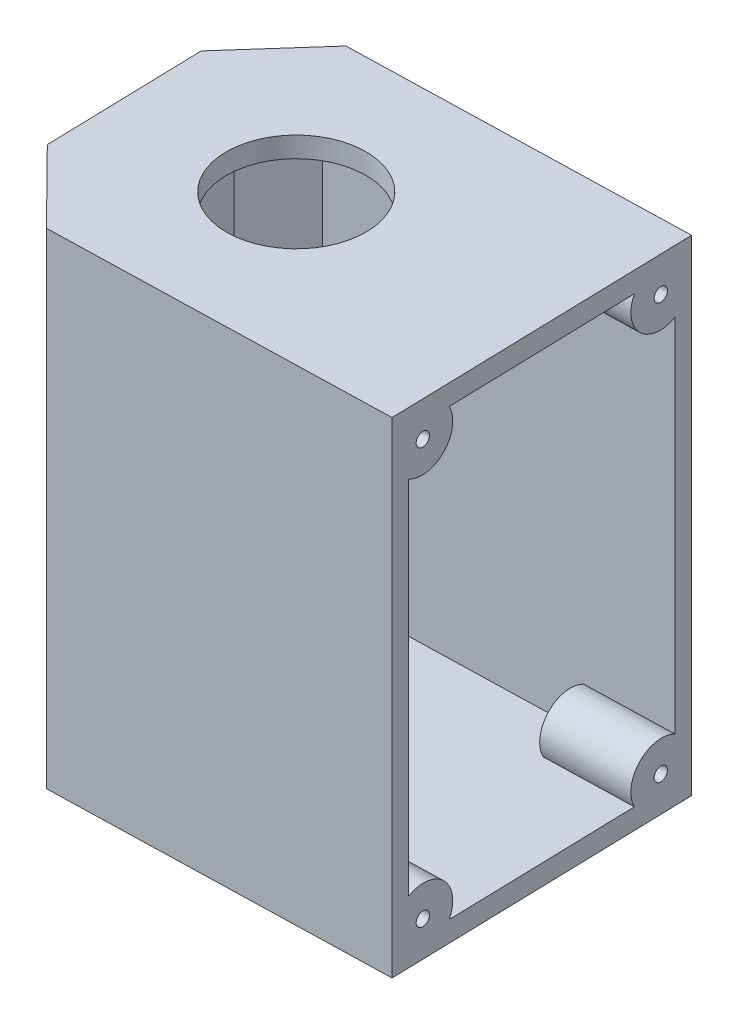
ISO-10303-21;
HEADER;
FILE_DESCRIPTION(('STEP AP214'),'2;1');
FILE_NAME('part.step','',(''),(''),'','','');
FILE_SCHEMA(('AUTOMOTIVE_DESIGN { 1 0 10303 214 1 1 1 1 }'));
ENDSEC;
DATA;
#1=APPLICATION_CONTEXT('core data for automotive mechanical design processes');
#2=APPLICATION_PROTOCOL_DEFINITION('international standard','automotive_design',2000,#1);
#3=PRODUCT_CONTEXT('',#1,'mechanical');
#4=PRODUCT('Part','Part','',(#3));
#5=PRODUCT_RELATED_PRODUCT_CATEGORY('part','',(#4));
#6=PRODUCT_DEFINITION_FORMATION('','',#4);
#7=PRODUCT_DEFINITION_CONTEXT('part definition',#1,'design');
#8=PRODUCT_DEFINITION('design','',#6,#7);
#9=PRODUCT_DEFINITION_SHAPE('','',#8);
#10=(LENGTH_UNIT() NAMED_UNIT(*) SI_UNIT(.MILLI.,.METRE.));
#11=(NAMED_UNIT(*) PLANE_ANGLE_UNIT() SI_UNIT($,.RADIAN.));
#12=(NAMED_UNIT(*) SI_UNIT($,.STERADIAN.) SOLID_ANGLE_UNIT());
#13=UNCERTAINTY_MEASURE_WITH_UNIT(LENGTH_MEASURE(1.E-05),#10,'distance_accuracy_value','');
#14=(GEOMETRIC_REPRESENTATION_CONTEXT(3) GLOBAL_UNCERTAINTY_ASSIGNED_CONTEXT((#13)) GLOBAL_UNIT_ASSIGNED_CONTEXT((#10,
#11,#12)) REPRESENTATION_CONTEXT('',''));
#15=CARTESIAN_POINT('',(0.,0.,0.));
#16=DIRECTION('',(0.,0.,1.));
#17=DIRECTION('',(1.,0.,0.));
#18=AXIS2_PLACEMENT_3D('',#15,#16,#17);
#19=CARTESIAN_POINT('',(0.,68.,0.));
#20=DIRECTION('',(0.,1.,0.));
#21=DIRECTION('',(0.,0.,1.));
#22=AXIS2_PLACEMENT_3D('',#19,#20,#21);
#23=PLANE('',#22);
#24=CARTESIAN_POINT('',(-17.8934203792558,68.,0.436006424415583));
#25=DIRECTION('',(0.,1.,0.));
#26=DIRECTION('',(0.,0.,1.));
#27=AXIS2_PLACEMENT_3D('',#24,#25,#26);
#28=CIRCLE('',#27,10.2);
#29=CARTESIAN_POINT('',(-17.8934203792558,68.,10.6360064244156));
#30=VERTEX_POINT('',#29);
#31=EDGE_CURVE('E319',#30,#30,#28,.F.);
#32=ORIENTED_EDGE('',*,*,#31,.F.);
#33=EDGE_LOOP('',(#32));
#34=FACE_BOUND('',#33,.T.);
#35=DIRECTION('',(-0.664307263992294,0.,0.747459603595454));
#36=VECTOR('',#35,1.);
#37=CARTESIAN_POINT('',(-28.3151559676767,68.,-25.1651911353096));
#38=LINE('',#37,#36);
#39=CARTESIAN_POINT('',(-33.6502390853678,68.,-19.1623076377953));
#40=VERTEX_POINT('',#39);
#41=CARTESIAN_POINT('',(-39.7506711500568,68.,-12.2982753142132));
#42=VERTEX_POINT('',#41);
#43=EDGE_CURVE('E182',#40,#42,#38,.T.);
#44=ORIENTED_EDGE('',*,*,#43,.F.);
#45=DIRECTION('',(0.999650770675558,0.,-0.0264260607689318));
#46=VECTOR('',#45,1.);
#47=CARTESIAN_POINT('',(-116.231008356699,68.,-16.9792608267229));
#48=LINE('',#47,#46);
#49=CARTESIAN_POINT('',(3.58326374035726,68.,-20.1465861850402));
#50=VERTEX_POINT('',#49);
#51=EDGE_CURVE('E189',#40,#50,#48,.T.);
#52=ORIENTED_EDGE('',*,*,#51,.T.);
#53=DIRECTION('',(-0.0264260607689318,0.,-0.999650770675558));
#54=VECTOR('',#53,1.);
#55=CARTESIAN_POINT('',(4.11297039872279,68.,-0.108727576555575));
#56=LINE('',#55,#54);
#57=CARTESIAN_POINT('',(3.74419705805505,68.,-14.0587656630687));
#58=VERTEX_POINT('',#57);
#59=EDGE_CURVE('E370',#58,#50,#56,.T.);
#60=ORIENTED_EDGE('',*,*,#59,.F.);
#61=DIRECTION('',(0.999650770675558,0.,-0.0264260607689318));
#62=VECTOR('',#61,1.);
#63=CARTESIAN_POINT('',(-49.1274945265591,68.,-12.6610870179285));
#64=LINE('',#63,#62);
#65=CARTESIAN_POINT('',(16.7396570768373,68.,-14.4023044530648));
#66=VERTEX_POINT('',#65);
#67=EDGE_CURVE('E255',#58,#66,#64,.T.);
#68=ORIENTED_EDGE('',*,*,#67,.T.);
#69=DIRECTION('',(0.0264260607689318,0.,0.999650770675558));
#70=VECTOR('',#69,1.);
#71=CARTESIAN_POINT('',(17.108430417505,68.,-0.452266366551688));
#72=LINE('',#71,#70);
#73=CARTESIAN_POINT('',(17.4752483112733,68.,13.4238006496144));
#74=VERTEX_POINT('',#73);
#75=EDGE_CURVE('E280',#66,#74,#72,.T.);
#76=ORIENTED_EDGE('',*,*,#75,.T.);
#77=DIRECTION('',(0.999650770675558,0.,-0.0264260607689318));
#78=VECTOR('',#77,1.);
#79=CARTESIAN_POINT('',(-48.3919032921231,68.,15.1650180847507));
#80=LINE('',#79,#78);
#81=CARTESIAN_POINT('',(4.479788292491,68.,13.7673394396105));
#82=VERTEX_POINT('',#81);
#83=EDGE_CURVE('E248',#82,#74,#80,.T.);
#84=ORIENTED_EDGE('',*,*,#83,.F.);
#85=CARTESIAN_POINT('',(4.64072161018879,68.,19.855159961582));
#86=VERTEX_POINT('',#85);
#87=EDGE_CURVE('E368',#86,#82,#56,.T.);
#88=ORIENTED_EDGE('',*,*,#87,.F.);
#89=DIRECTION('',(0.999650770675558,0.,-0.0264260607689318));
#90=VECTOR('',#89,1.);
#91=CARTESIAN_POINT('',(-115.173550486868,68.,23.0224853198993));
#92=LINE('',#91,#90);
#93=CARTESIAN_POINT('',(-32.5927812155363,68.,20.8394385088269));
#94=VERTEX_POINT('',#93);
#95=EDGE_CURVE('E207',#94,#86,#92,.T.);
#96=ORIENTED_EDGE('',*,*,#95,.F.);
#97=DIRECTION('',(0.702870473293746,0.,0.711317859871257));
#98=VECTOR('',#97,1.);
#99=CARTESIAN_POINT('',(-26.9100461971686,68.,26.5904709750769));
#100=LINE('',#99,#98);
#101=CARTESIAN_POINT('',(-39.0473449468371,68.,14.3073011745663));
#102=VERTEX_POINT('',#101);
#103=EDGE_CURVE('E326',#102,#94,#100,.T.);
#104=ORIENTED_EDGE('',*,*,#103,.F.);
#105=DIRECTION('',(0.0264260607689317,0.,0.999650770675558));
#106=VECTOR('',#105,1.);
#107=CARTESIAN_POINT('',(-39.3980303249972,68.,1.04149846535005));
#108=LINE('',#107,#106);
#109=EDGE_CURVE('E192',#42,#102,#108,.T.);
#110=ORIENTED_EDGE('',*,*,#109,.F.);
#111=EDGE_LOOP('',(#44,#52,#60,#68,#76,#84,#88,#96,#104,#110));
#112=FACE_BOUND('',#111,.T.);
#113=ADVANCED_FACE('F46',(#34,#112),#23,.F.);
#114=CARTESIAN_POINT('',(0.,3.,0.));
#115=DIRECTION('',(0.,1.,0.));
#116=DIRECTION('',(0.,0.,1.));
#117=AXIS2_PLACEMENT_3D('',#114,#115,#116);
#118=PLANE('',#117);
#119=CARTESIAN_POINT('',(-17.8934203792558,3.,0.436006424415583));
#120=DIRECTION('',(0.,1.,0.));
#121=DIRECTION('',(0.,0.,1.));
#122=AXIS2_PLACEMENT_3D('',#119,#120,#121);
#123=CIRCLE('',#122,4.5);
#124=CARTESIAN_POINT('',(-17.8934203792558,3.,4.93600642441559));
#125=VERTEX_POINT('',#124);
#126=EDGE_CURVE('E316',#125,#125,#123,.F.);
#127=ORIENTED_EDGE('',*,*,#126,.T.);
#128=EDGE_LOOP('',(#127));
#129=FACE_BOUND('',#128,.T.);
#130=DIRECTION('',(0.999650770675558,0.,-0.0264260607689318));
#131=VECTOR('',#130,1.);
#132=CARTESIAN_POINT('',(-116.231008356699,3.,-16.9792608267229));
#133=LINE('',#132,#131);
#134=CARTESIAN_POINT('',(-33.6502390853678,3.,-19.1623076377953));
#135=VERTEX_POINT('',#134);
#136=CARTESIAN_POINT('',(3.58326374035726,3.,-20.1465861850402));
#137=VERTEX_POINT('',#136);
#138=EDGE_CURVE('E200',#135,#137,#133,.T.);
#139=ORIENTED_EDGE('',*,*,#138,.F.);
#140=DIRECTION('',(-0.664307263992294,0.,0.747459603595454));
#141=VECTOR('',#140,1.);
#142=CARTESIAN_POINT('',(-28.3151559676767,3.,-25.1651911353096));
#143=LINE('',#142,#141);
#144=CARTESIAN_POINT('',(-39.7506711500568,3.,-12.2982753142132));
#145=VERTEX_POINT('',#144);
#146=EDGE_CURVE('E61',#135,#145,#143,.T.);
#147=ORIENTED_EDGE('',*,*,#146,.T.);
#148=DIRECTION('',(0.0264260607689317,0.,0.999650770675558));
#149=VECTOR('',#148,1.);
#150=CARTESIAN_POINT('',(-39.3980303249972,3.,1.04149846535005));
#151=LINE('',#150,#149);
#152=CARTESIAN_POINT('',(-39.0473449468371,3.,14.3073011745663));
#153=VERTEX_POINT('',#152);
#154=EDGE_CURVE('E271',#145,#153,#151,.T.);
#155=ORIENTED_EDGE('',*,*,#154,.T.);
#156=DIRECTION('',(0.702870473293746,0.,0.711317859871257));
#157=VECTOR('',#156,1.);
#158=CARTESIAN_POINT('',(-26.9100461971686,3.,26.5904709750769));
#159=LINE('',#158,#157);
#160=CARTESIAN_POINT('',(-32.5927812155363,3.,20.8394385088269));
#161=VERTEX_POINT('',#160);
#162=EDGE_CURVE('E327',#153,#161,#159,.T.);
#163=ORIENTED_EDGE('',*,*,#162,.T.);
#164=DIRECTION('',(0.999650770675558,0.,-0.0264260607689318));
#165=VECTOR('',#164,1.);
#166=CARTESIAN_POINT('',(-115.173550486868,3.,23.0224853198993));
#167=LINE('',#166,#165);
#168=CARTESIAN_POINT('',(4.64072161018879,3.,19.855159961582));
#169=VERTEX_POINT('',#168);
#170=EDGE_CURVE('E369',#161,#169,#167,.T.);
#171=ORIENTED_EDGE('',*,*,#170,.T.);
#172=DIRECTION('',(0.0264260607689318,0.,0.999650770675558));
#173=VECTOR('',#172,1.);
#174=CARTESIAN_POINT('',(4.11297039872279,3.,-0.108727576555575));
#175=LINE('',#174,#173);
#176=CARTESIAN_POINT('',(4.479788292491,3.,13.7673394396105));
#177=VERTEX_POINT('',#176);
#178=EDGE_CURVE('E315',#177,#169,#175,.T.);
#179=ORIENTED_EDGE('',*,*,#178,.F.);
#180=DIRECTION('',(0.999650770675558,0.,-0.0264260607689318));
#181=VECTOR('',#180,1.);
#182=CARTESIAN_POINT('',(-48.3919032921231,3.,15.1650180847507));
#183=LINE('',#182,#181);
#184=CARTESIAN_POINT('',(17.4752483112732,3.,13.4238006496144));
#185=VERTEX_POINT('',#184);
#186=EDGE_CURVE('E262',#177,#185,#183,.T.);
#187=ORIENTED_EDGE('',*,*,#186,.T.);
#188=DIRECTION('',(-0.0264260607689318,0.,-0.999650770675558));
#189=VECTOR('',#188,1.);
#190=CARTESIAN_POINT('',(17.636181628971,3.,19.5116211715859));
#191=LINE('',#190,#189);
#192=CARTESIAN_POINT('',(16.7396570768373,3.,-14.4023044530648));
#193=VERTEX_POINT('',#192);
#194=EDGE_CURVE('E293',#185,#193,#191,.T.);
#195=ORIENTED_EDGE('',*,*,#194,.T.);
#196=DIRECTION('',(0.999650770675558,0.,-0.0264260607689318));
#197=VECTOR('',#196,1.);
#198=CARTESIAN_POINT('',(-49.1274945265591,3.,-12.6610870179285));
#199=LINE('',#198,#197);
#200=CARTESIAN_POINT('',(3.74419705805505,3.,-14.0587656630687));
#201=VERTEX_POINT('',#200);
#202=EDGE_CURVE('E269',#201,#193,#199,.T.);
#203=ORIENTED_EDGE('',*,*,#202,.F.);
#204=DIRECTION('',(-0.0264260607689318,0.,-0.999650770675558));
#205=VECTOR('',#204,1.);
#206=CARTESIAN_POINT('',(4.11297039872279,3.,-0.108727576555575));
#207=LINE('',#206,#205);
#208=EDGE_CURVE('E204',#201,#137,#207,.T.);
#209=ORIENTED_EDGE('',*,*,#208,.T.);
#210=EDGE_LOOP('',(#139,#147,#155,#163,#171,#179,#187,#195,#203,#209));
#211=FACE_BOUND('',#210,.T.);
#212=ADVANCED_FACE('F401',(#129,#211),#118,.T.);
#213=CARTESIAN_POINT('',(-39.3980303249972,0.,1.04149846535005));
#214=DIRECTION('',(-0.999650770675558,0.,0.0264260607689317));
#215=DIRECTION('',(0.0264260607689317,0.,0.999650770675558));
#216=AXIS2_PLACEMENT_3D('',#213,#214,#215);
#217=PLANE('',#216);
#218=DIRECTION('',(0.,-1.,0.));
#219=VECTOR('',#218,1.);
#220=CARTESIAN_POINT('',(-39.7506711500568,0.,-12.2982753142132));
#221=LINE('',#220,#219);
#222=EDGE_CURVE('E193',#42,#145,#221,.T.);
#223=ORIENTED_EDGE('',*,*,#222,.F.);
#224=ORIENTED_EDGE('',*,*,#109,.T.);
#225=DIRECTION('',(0.,1.,0.));
#226=VECTOR('',#225,1.);
#227=CARTESIAN_POINT('',(-39.0473449468371,0.,14.3073011745663));
#228=LINE('',#227,#226);
#229=EDGE_CURVE('E54',#153,#102,#228,.T.);
#230=ORIENTED_EDGE('',*,*,#229,.F.);
#231=ORIENTED_EDGE('',*,*,#154,.F.);
#232=EDGE_LOOP('',(#223,#224,#230,#231));
#233=FACE_BOUND('',#232,.T.);
#234=ADVANCED_FACE('F330',(#233),#217,.F.);
#235=CARTESIAN_POINT('',(16.5787237591395,71.,-20.4901249750363));
#236=DIRECTION('',(0.0264260607689319,0.,0.999650770675558));
#237=DIRECTION('',(0.999650770675558,0.,-0.0264260607689319));
#238=AXIS2_PLACEMENT_3D('',#235,#236,#237);
#239=PLANE('',#238);
#240=ORIENTED_EDGE('',*,*,#51,.F.);
#241=DIRECTION('',(0.,-1.,0.));
#242=VECTOR('',#241,1.);
#243=CARTESIAN_POINT('',(-33.6502390853678,71.,-19.1623076377953));
#244=LINE('',#243,#242);
#245=EDGE_CURVE('E11',#40,#135,#244,.T.);
#246=ORIENTED_EDGE('',*,*,#245,.T.);
#247=ORIENTED_EDGE('',*,*,#138,.T.);
#248=DIRECTION('',(0.,-1.,0.));
#249=VECTOR('',#248,1.);
#250=CARTESIAN_POINT('',(3.58326374035726,0.,-20.1465861850402));
#251=LINE('',#250,#249);
#252=CARTESIAN_POINT('',(3.58326374035726,9.08994731015653,-20.1465861850402));
#253=VERTEX_POINT('',#252);
#254=EDGE_CURVE('E199',#253,#137,#251,.T.);
#255=ORIENTED_EDGE('',*,*,#254,.F.);
#256=DIRECTION('',(0.999650770675558,0.,-0.0264260607689318));
#257=VECTOR('',#256,1.);
#258=CARTESIAN_POINT('',(-49.2884278442568,9.08994731015653,-18.7489075399));
#259=LINE('',#258,#257);
#260=CARTESIAN_POINT('',(16.5787237591395,9.08994731015653,-20.4901249750363));
#261=VERTEX_POINT('',#260);
#262=EDGE_CURVE('E268',#253,#261,#259,.T.);
#263=ORIENTED_EDGE('',*,*,#262,.T.);
#264=DIRECTION('',(0.,-1.,0.));
#265=VECTOR('',#264,1.);
#266=CARTESIAN_POINT('',(16.5787237591395,71.,-20.4901249750363));
#267=LINE('',#266,#265);
#268=CARTESIAN_POINT('',(16.5787237591395,61.9100526898435,-20.4901249750363));
#269=VERTEX_POINT('',#268);
#270=EDGE_CURVE('E296',#269,#261,#267,.T.);
#271=ORIENTED_EDGE('',*,*,#270,.F.);
#272=DIRECTION('',(0.999650770675558,0.,-0.0264260607689318));
#273=VECTOR('',#272,1.);
#274=CARTESIAN_POINT('',(-49.2884278442568,61.9100526898435,-18.7489075399));
#275=LINE('',#274,#273);
#276=CARTESIAN_POINT('',(3.58326374035726,61.9100526898435,-20.1465861850402));
#277=VERTEX_POINT('',#276);
#278=EDGE_CURVE('E254',#277,#269,#275,.T.);
#279=ORIENTED_EDGE('',*,*,#278,.F.);
#280=EDGE_CURVE('E198',#50,#277,#251,.T.);
#281=ORIENTED_EDGE('',*,*,#280,.F.);
#282=EDGE_LOOP('',(#240,#246,#247,#255,#263,#271,#279,#281));
#283=FACE_BOUND('',#282,.T.);
#284=ADVANCED_FACE('F196',(#283),#239,.T.);
#285=CARTESIAN_POINT('',(-52.3655645176512,71.,21.3621378238682));
#286=DIRECTION('',(-0.026426060768932,0.,-0.999650770675558));
#287=DIRECTION('',(-0.999650770675558,0.,0.026426060768932));
#288=AXIS2_PLACEMENT_3D('',#285,#286,#287);
#289=PLANE('',#288);
#290=ORIENTED_EDGE('',*,*,#170,.F.);
#291=DIRECTION('',(0.,1.,0.));
#292=VECTOR('',#291,1.);
#293=CARTESIAN_POINT('',(-32.5927812155363,71.,20.8394385088269));
#294=LINE('',#293,#292);
#295=EDGE_CURVE('E68',#161,#94,#294,.T.);
#296=ORIENTED_EDGE('',*,*,#295,.T.);
#297=ORIENTED_EDGE('',*,*,#95,.T.);
#298=DIRECTION('',(0.,1.,0.));
#299=VECTOR('',#298,1.);
#300=CARTESIAN_POINT('',(4.64072161018879,0.,19.855159961582));
#301=LINE('',#300,#299);
#302=CARTESIAN_POINT('',(4.64072161018879,61.9100526898435,19.855159961582));
#303=VERTEX_POINT('',#302);
#304=EDGE_CURVE('E367',#303,#86,#301,.T.);
#305=ORIENTED_EDGE('',*,*,#304,.F.);
#306=DIRECTION('',(0.999650770675558,0.,-0.0264260607689318));
#307=VECTOR('',#306,1.);
#308=CARTESIAN_POINT('',(-48.2309699744253,61.9100526898435,21.2528386067222));
#309=LINE('',#308,#307);
#310=CARTESIAN_POINT('',(17.636181628971,61.9100526898435,19.5116211715859));
#311=VERTEX_POINT('',#310);
#312=EDGE_CURVE('E247',#303,#311,#309,.T.);
#313=ORIENTED_EDGE('',*,*,#312,.T.);
#314=DIRECTION('',(0.,-1.,0.));
#315=VECTOR('',#314,1.);
#316=CARTESIAN_POINT('',(17.636181628971,71.,19.5116211715859));
#317=LINE('',#316,#315);
#318=CARTESIAN_POINT('',(17.636181628971,9.08994731015653,19.5116211715859));
#319=VERTEX_POINT('',#318);
#320=EDGE_CURVE('E299',#311,#319,#317,.T.);
#321=ORIENTED_EDGE('',*,*,#320,.T.);
#322=DIRECTION('',(0.999650770675558,0.,-0.0264260607689318));
#323=VECTOR('',#322,1.);
#324=CARTESIAN_POINT('',(-48.2309699744253,9.08994731015653,21.2528386067222));
#325=LINE('',#324,#323);
#326=CARTESIAN_POINT('',(4.64072161018879,9.08994731015653,19.855159961582));
#327=VERTEX_POINT('',#326);
#328=EDGE_CURVE('E261',#327,#319,#325,.T.);
#329=ORIENTED_EDGE('',*,*,#328,.F.);
#330=EDGE_CURVE('E365',#169,#327,#301,.T.);
#331=ORIENTED_EDGE('',*,*,#330,.F.);
#332=EDGE_LOOP('',(#290,#296,#297,#305,#313,#321,#329,#331));
#333=FACE_BOUND('',#332,.T.);
#334=ADVANCED_FACE('F393',(#333),#289,.T.);
#335=CARTESIAN_POINT('',(0.,0.,0.));
#336=DIRECTION('',(0.,1.,0.));
#337=DIRECTION('',(0.,0.,1.));
#338=AXIS2_PLACEMENT_3D('',#335,#336,#337);
#339=PLANE('',#338);
#340=DIRECTION('',(0.664307263992294,0.,-0.747459603595454));
#341=VECTOR('',#340,1.);
#342=CARTESIAN_POINT('',(-29.0626155712721,0.,-25.8294983993019));
#343=LINE('',#342,#341);
#344=CARTESIAN_POINT('',(-42.7036780374664,0.,-10.4809636228995));
#345=VERTEX_POINT('',#344);
#346=CARTESIAN_POINT('',(-32.744156390403,0.,-21.6871335774113));
#347=VERTEX_POINT('',#346);
#348=EDGE_CURVE('E353',#345,#347,#343,.T.);
#349=ORIENTED_EDGE('',*,*,#348,.T.);
#350=DIRECTION('',(-0.999650770675558,0.,0.0264260607689319));
#351=VECTOR('',#350,1.);
#352=CARTESIAN_POINT('',(-55.9882144660939,0.,-21.0726700975206));
#353=LINE('',#352,#351);
#354=CARTESIAN_POINT('',(16.5126586072172,0.,-22.9892519017252));
#355=VERTEX_POINT('',#354);
#356=EDGE_CURVE('E309',#355,#347,#353,.T.);
#357=ORIENTED_EDGE('',*,*,#356,.F.);
#358=DIRECTION('',(-0.0264260607689318,0.,-0.999650770675558));
#359=VECTOR('',#358,1.);
#360=CARTESIAN_POINT('',(17.7022467808934,0.,22.0107480982748));
#361=LINE('',#360,#359);
#362=CARTESIAN_POINT('',(17.7022467808934,0.,22.0107480982748));
#363=VERTEX_POINT('',#362);
#364=EDGE_CURVE('E286',#363,#355,#361,.T.);
#365=ORIENTED_EDGE('',*,*,#364,.F.);
#366=DIRECTION('',(0.999650770675558,0.,-0.0264260607689319));
#367=VECTOR('',#366,1.);
#368=CARTESIAN_POINT('',(20.2013737075823,0.,21.9446829463524));
#369=LINE('',#368,#367);
#370=CARTESIAN_POINT('',(-31.5545682167268,0.,23.3128664225887));
#371=VERTEX_POINT('',#370);
#372=EDGE_CURVE('E307',#371,#363,#369,.T.);
#373=ORIENTED_EDGE('',*,*,#372,.F.);
#374=DIRECTION('',(0.702870473293746,0.,0.711317859871257));
#375=VECTOR('',#374,1.);
#376=CARTESIAN_POINT('',(-27.6213640570398,0.,27.2933414483706));
#377=LINE('',#376,#375);
#378=CARTESIAN_POINT('',(-42.0922426834808,0.,12.6485458478662));
#379=VERTEX_POINT('',#378);
#380=EDGE_CURVE('E347',#379,#371,#377,.T.);
#381=ORIENTED_EDGE('',*,*,#380,.F.);
#382=DIRECTION('',(0.0264260607689317,0.,0.999650770675558));
#383=VECTOR('',#382,1.);
#384=CARTESIAN_POINT('',(-42.9927544473117,0.,-21.4162088875167));
#385=LINE('',#384,#383);
#386=EDGE_CURVE('E274',#345,#379,#385,.T.);
#387=ORIENTED_EDGE('',*,*,#386,.F.);
#388=EDGE_LOOP('',(#349,#357,#365,#373,#381,#387));
#389=FACE_BOUND('',#388,.T.);
#390=CARTESIAN_POINT('',(-17.8934203792558,0.,0.436006424415583));
#391=DIRECTION('',(0.,-1.,0.));
#392=DIRECTION('',(0.,0.,-1.));
#393=AXIS2_PLACEMENT_3D('',#390,#391,#392);
#394=CIRCLE('',#393,4.5);
#395=CARTESIAN_POINT('',(-17.8934203792558,0.,-4.06399357558442));
#396=VERTEX_POINT('',#395);
#397=EDGE_CURVE('E318',#396,#396,#394,.T.);
#398=ORIENTED_EDGE('',*,*,#397,.F.);
#399=EDGE_LOOP('',(#398));
#400=FACE_BOUND('',#399,.T.);
#401=ADVANCED_FACE('F455',(#389,#400),#339,.F.);
#402=CARTESIAN_POINT('',(20.2013737075823,3.,21.9446829463524));
#403=DIRECTION('',(-0.0264260607689319,0.,-0.999650770675558));
#404=DIRECTION('',(-0.999650770675558,0.,0.0264260607689319));
#405=AXIS2_PLACEMENT_3D('',#402,#403,#404);
#406=PLANE('',#405);
#407=DIRECTION('',(0.,1.,0.));
#408=VECTOR('',#407,1.);
#409=CARTESIAN_POINT('',(-31.5545682167268,-125.999999999999,23.3128664225887));
#410=LINE('',#409,#408);
#411=CARTESIAN_POINT('',(-31.5545682167268,71.,23.3128664225887));
#412=VERTEX_POINT('',#411);
#413=EDGE_CURVE('E343',#371,#412,#410,.T.);
#414=ORIENTED_EDGE('',*,*,#413,.F.);
#415=ORIENTED_EDGE('',*,*,#372,.T.);
#416=DIRECTION('',(0.,-1.,0.));
#417=VECTOR('',#416,1.);
#418=CARTESIAN_POINT('',(17.7022467808934,71.,22.0107480982748));
#419=LINE('',#418,#417);
#420=CARTESIAN_POINT('',(17.7022467808934,71.,22.0107480982748));
#421=VERTEX_POINT('',#420);
#422=EDGE_CURVE('E283',#421,#363,#419,.T.);
#423=ORIENTED_EDGE('',*,*,#422,.F.);
#424=DIRECTION('',(0.999650770675558,0.,-0.0264260607689319));
#425=VECTOR('',#424,1.);
#426=CARTESIAN_POINT('',(-54.7986262924177,71.,23.9273299024794));
#427=LINE('',#426,#425);
#428=EDGE_CURVE('E302',#412,#421,#427,.T.);
#429=ORIENTED_EDGE('',*,*,#428,.F.);
#430=EDGE_LOOP('',(#414,#415,#423,#429));
#431=FACE_BOUND('',#430,.T.);
#432=ADVANCED_FACE('F48',(#431),#406,.F.);
#433=CARTESIAN_POINT('',(0.,71.,0.));
#434=DIRECTION('',(0.,1.,0.));
#435=DIRECTION('',(0.,0.,1.));
#436=AXIS2_PLACEMENT_3D('',#433,#434,#435);
#437=PLANE('',#436);
#438=DIRECTION('',(-0.999650770675558,0.,0.0264260607689319));
#439=VECTOR('',#438,1.);
#440=CARTESIAN_POINT('',(19.0117855339061,71.,-23.0553170536476));
#441=LINE('',#440,#439);
#442=CARTESIAN_POINT('',(16.5126586072172,71.,-22.9892519017252));
#443=VERTEX_POINT('',#442);
#444=CARTESIAN_POINT('',(-32.744156390403,71.,-21.6871335774113));
#445=VERTEX_POINT('',#444);
#446=EDGE_CURVE('E304',#443,#445,#441,.T.);
#447=ORIENTED_EDGE('',*,*,#446,.T.);
#448=DIRECTION('',(0.664307263992294,0.,-0.747459603595454));
#449=VECTOR('',#448,1.);
#450=CARTESIAN_POINT('',(-29.0626155712721,71.,-25.8294983993019));
#451=LINE('',#450,#449);
#452=CARTESIAN_POINT('',(-42.7036780374664,71.,-10.4809636228995));
#453=VERTEX_POINT('',#452);
#454=EDGE_CURVE('E340',#453,#445,#451,.T.);
#455=ORIENTED_EDGE('',*,*,#454,.F.);
#456=DIRECTION('',(-0.0264260607689317,0.,-0.999650770675558));
#457=VECTOR('',#456,1.);
#458=CARTESIAN_POINT('',(-41.8031662736355,71.,23.5837911124833));
#459=LINE('',#458,#457);
#460=CARTESIAN_POINT('',(-42.0922426834808,71.,12.6485458478662));
#461=VERTEX_POINT('',#460);
#462=EDGE_CURVE('E277',#461,#453,#459,.T.);
#463=ORIENTED_EDGE('',*,*,#462,.F.);
#464=DIRECTION('',(0.702870473293746,0.,0.711317859871257));
#465=VECTOR('',#464,1.);
#466=CARTESIAN_POINT('',(-27.6213640570398,71.,27.2933414483706));
#467=LINE('',#466,#465);
#468=EDGE_CURVE('E332',#461,#412,#467,.T.);
#469=ORIENTED_EDGE('',*,*,#468,.T.);
#470=ORIENTED_EDGE('',*,*,#428,.T.);
#471=DIRECTION('',(0.0264260607689318,0.,0.999650770675558));
#472=VECTOR('',#471,1.);
#473=CARTESIAN_POINT('',(16.5126586072172,71.,-22.9892519017252));
#474=LINE('',#473,#472);
#475=EDGE_CURVE('E290',#443,#421,#474,.T.);
#476=ORIENTED_EDGE('',*,*,#475,.F.);
#477=EDGE_LOOP('',(#447,#455,#463,#469,#470,#476));
#478=FACE_BOUND('',#477,.T.);
#479=CARTESIAN_POINT('',(-17.8934203792558,71.,0.436006424415583));
#480=DIRECTION('',(0.,1.,0.));
#481=DIRECTION('',(0.,0.,1.));
#482=AXIS2_PLACEMENT_3D('',#479,#480,#481);
#483=CIRCLE('',#482,10.2);
#484=CARTESIAN_POINT('',(-17.8934203792558,71.,10.6360064244156));
#485=VERTEX_POINT('',#484);
#486=EDGE_CURVE('E356',#485,#485,#483,.T.);
#487=ORIENTED_EDGE('',*,*,#486,.F.);
#488=EDGE_LOOP('',(#487));
#489=FACE_BOUND('',#488,.T.);
#490=ADVANCED_FACE('F456',(#478,#489),#437,.T.);
#491=CARTESIAN_POINT('',(-42.3969826370238,0.,1.12077664765685));
#492=DIRECTION('',(-0.999650770675558,0.,0.0264260607689317));
#493=DIRECTION('',(0.0264260607689317,0.,0.999650770675558));
#494=AXIS2_PLACEMENT_3D('',#491,#492,#493);
#495=PLANE('',#494);
#496=DIRECTION('',(0.,1.,0.));
#497=VECTOR('',#496,1.);
#498=CARTESIAN_POINT('',(-42.7036780374664,-125.999999999999,-10.4809636228995));
#499=LINE('',#498,#497);
#500=EDGE_CURVE('E342',#345,#453,#499,.T.);
#501=ORIENTED_EDGE('',*,*,#500,.F.);
#502=ORIENTED_EDGE('',*,*,#386,.T.);
#503=DIRECTION('',(0.,1.,0.));
#504=VECTOR('',#503,1.);
#505=CARTESIAN_POINT('',(-42.0922426834808,-125.999999999999,12.6485458478662));
#506=LINE('',#505,#504);
#507=EDGE_CURVE('E335',#379,#461,#506,.T.);
#508=ORIENTED_EDGE('',*,*,#507,.T.);
#509=ORIENTED_EDGE('',*,*,#462,.T.);
#510=EDGE_LOOP('',(#501,#502,#508,#509));
#511=FACE_BOUND('',#510,.T.);
#512=ADVANCED_FACE('F446',(#511),#495,.T.);
#513=CARTESIAN_POINT('',(-17.8934203792558,72.9999999999986,0.436006424415583));
#514=DIRECTION('',(0.,-1.,0.));
#515=DIRECTION('',(0.,0.,-1.));
#516=AXIS2_PLACEMENT_3D('',#513,#514,#515);
#517=CYLINDRICAL_SURFACE('',#516,4.5);
#518=ORIENTED_EDGE('',*,*,#397,.T.);
#519=EDGE_LOOP('',(#518));
#520=FACE_BOUND('',#519,.T.);
#521=ORIENTED_EDGE('',*,*,#126,.F.);
#522=EDGE_LOOP('',(#521));
#523=FACE_BOUND('',#522,.T.);
#524=ADVANCED_FACE('F463',(#520,#523),#517,.F.);
#525=CARTESIAN_POINT('',(-55.9882144660939,3.,-21.0726700975206));
#526=DIRECTION('',(0.0264260607689319,0.,0.999650770675558));
#527=DIRECTION('',(0.999650770675558,0.,-0.0264260607689319));
#528=AXIS2_PLACEMENT_3D('',#525,#526,#527);
#529=PLANE('',#528);
#530=ORIENTED_EDGE('',*,*,#356,.T.);
#531=DIRECTION('',(0.,1.,0.));
#532=VECTOR('',#531,1.);
#533=CARTESIAN_POINT('',(-32.744156390403,-125.999999999999,-21.6871335774113));
#534=LINE('',#533,#532);
#535=EDGE_CURVE('E344',#347,#445,#534,.T.);
#536=ORIENTED_EDGE('',*,*,#535,.T.);
#537=ORIENTED_EDGE('',*,*,#446,.F.);
#538=DIRECTION('',(0.,1.,0.));
#539=VECTOR('',#538,1.);
#540=CARTESIAN_POINT('',(16.5126586072172,0.,-22.9892519017252));
#541=LINE('',#540,#539);
#542=EDGE_CURVE('E288',#355,#443,#541,.T.);
#543=ORIENTED_EDGE('',*,*,#542,.F.);
#544=EDGE_LOOP('',(#530,#536,#537,#543));
#545=FACE_BOUND('',#544,.T.);
#546=ADVANCED_FACE('F450',(#545),#529,.F.);
#547=CARTESIAN_POINT('',(17.108430417505,0.,-0.452266366551688));
#548=DIRECTION('',(0.999650770675558,0.,-0.0264260607689318));
#549=DIRECTION('',(-0.0264260607689318,0.,-0.999650770675558));
#550=AXIS2_PLACEMENT_3D('',#547,#548,#549);
#551=PLANE('',#550);
#552=CARTESIAN_POINT('',(17.5801234886618,65.8786796564404,17.3910416552967));
#553=DIRECTION('',(0.999650770675558,0.,-0.0264260607689318));
#554=DIRECTION('',(-0.0264260607689318,0.,-0.999650770675558));
#555=AXIS2_PLACEMENT_3D('',#552,#553,#554);
#556=CIRCLE('',#555,4.5);
#557=EDGE_CURVE('E244',#311,#74,#556,.T.);
#558=ORIENTED_EDGE('',*,*,#557,.T.);
#559=ORIENTED_EDGE('',*,*,#75,.F.);
#560=CARTESIAN_POINT('',(16.6347818994488,65.8786796564404,-18.3695454587472));
#561=DIRECTION('',(0.999650770675558,0.,-0.0264260607689318));
#562=DIRECTION('',(-0.0264260607689318,0.,-0.999650770675558));
#563=AXIS2_PLACEMENT_3D('',#560,#561,#562);
#564=CIRCLE('',#563,4.5);
#565=EDGE_CURVE('E250',#269,#66,#564,.F.);
#566=ORIENTED_EDGE('',*,*,#565,.F.);
#567=ORIENTED_EDGE('',*,*,#270,.T.);
#568=CARTESIAN_POINT('',(16.6347818994488,5.12132034355964,-18.3695454587472));
#569=DIRECTION('',(0.999650770675558,0.,-0.0264260607689318));
#570=DIRECTION('',(-0.0264260607689318,0.,-0.999650770675558));
#571=AXIS2_PLACEMENT_3D('',#568,#569,#570);
#572=CIRCLE('',#571,4.5);
#573=EDGE_CURVE('E264',#261,#193,#572,.T.);
#574=ORIENTED_EDGE('',*,*,#573,.T.);
#575=ORIENTED_EDGE('',*,*,#194,.F.);
#576=CARTESIAN_POINT('',(17.5801234886618,5.12132034355964,17.3910416552967));
#577=DIRECTION('',(0.999650770675558,0.,-0.0264260607689318));
#578=DIRECTION('',(-0.0264260607689318,0.,-0.999650770675558));
#579=AXIS2_PLACEMENT_3D('',#576,#577,#578);
#580=CIRCLE('',#579,4.5);
#581=EDGE_CURVE('E257',#319,#185,#580,.F.);
#582=ORIENTED_EDGE('',*,*,#581,.F.);
#583=ORIENTED_EDGE('',*,*,#320,.F.);
#584=EDGE_LOOP('',(#558,#559,#566,#567,#574,#575,#582,#583));
#585=FACE_BOUND('',#584,.T.);
#586=ORIENTED_EDGE('',*,*,#475,.T.);
#587=ORIENTED_EDGE('',*,*,#422,.T.);
#588=ORIENTED_EDGE('',*,*,#364,.T.);
#589=ORIENTED_EDGE('',*,*,#542,.T.);
#590=EDGE_LOOP('',(#586,#587,#588,#589));
#591=FACE_BOUND('',#590,.T.);
#592=CARTESIAN_POINT('',(17.5801234886618,5.12132034355964,17.3910416552967));
#593=DIRECTION('',(0.999650770675558,0.,-0.0264260607689318));
#594=DIRECTION('',(-0.0264260607689318,0.,-0.999650770675558));
#595=AXIS2_PLACEMENT_3D('',#592,#593,#594);
#596=CIRCLE('',#595,1.);
#597=CARTESIAN_POINT('',(17.5536974278928,5.12132034355964,16.3913908846212));
#598=VERTEX_POINT('',#597);
#599=EDGE_CURVE('E241',#598,#598,#596,.T.);
#600=ORIENTED_EDGE('',*,*,#599,.F.);
#601=EDGE_LOOP('',(#600));
#602=FACE_BOUND('',#601,.T.);
#603=CARTESIAN_POINT('',(16.6347818994488,5.12132034355964,-18.3695454587472));
#604=DIRECTION('',(0.999650770675558,0.,-0.0264260607689318));
#605=DIRECTION('',(-0.0264260607689318,0.,-0.999650770675558));
#606=AXIS2_PLACEMENT_3D('',#603,#604,#605);
#607=CIRCLE('',#606,1.);
#608=CARTESIAN_POINT('',(16.6083558386799,5.12132034355964,-19.3691962294228));
#609=VERTEX_POINT('',#608);
#610=EDGE_CURVE('E238',#609,#609,#607,.T.);
#611=ORIENTED_EDGE('',*,*,#610,.F.);
#612=EDGE_LOOP('',(#611));
#613=FACE_BOUND('',#612,.T.);
#614=CARTESIAN_POINT('',(17.5801234886618,65.8786796564404,17.3910416552967));
#615=DIRECTION('',(0.999650770675558,0.,-0.0264260607689318));
#616=DIRECTION('',(-0.0264260607689318,0.,-0.999650770675558));
#617=AXIS2_PLACEMENT_3D('',#614,#615,#616);
#618=CIRCLE('',#617,1.);
#619=CARTESIAN_POINT('',(17.5536974278928,65.8786796564404,16.3913908846212));
#620=VERTEX_POINT('',#619);
#621=EDGE_CURVE('E235',#620,#620,#618,.T.);
#622=ORIENTED_EDGE('',*,*,#621,.F.);
#623=EDGE_LOOP('',(#622));
#624=FACE_BOUND('',#623,.T.);
#625=CARTESIAN_POINT('',(16.6347818994488,65.8786796564404,-18.3695454587472));
#626=DIRECTION('',(0.999650770675558,0.,-0.0264260607689318));
#627=DIRECTION('',(-0.0264260607689318,0.,-0.999650770675558));
#628=AXIS2_PLACEMENT_3D('',#625,#626,#627);
#629=CIRCLE('',#628,1.);
#630=CARTESIAN_POINT('',(16.6083558386799,65.8786796564404,-19.3691962294228));
#631=VERTEX_POINT('',#630);
#632=EDGE_CURVE('E232',#631,#631,#629,.T.);
#633=ORIENTED_EDGE('',*,*,#632,.F.);
#634=EDGE_LOOP('',(#633));
#635=FACE_BOUND('',#634,.T.);
#636=ADVANCED_FACE('F387',(#585,#591,#602,#613,#624,#635),#551,.T.);
#637=CARTESIAN_POINT('',(-49.2323697039476,5.12132034355964,-16.6283280236108));
#638=DIRECTION('',(0.999650770675558,0.,-0.0264260607689318));
#639=DIRECTION('',(-0.0264260607689318,0.,-0.999650770675558));
#640=AXIS2_PLACEMENT_3D('',#637,#638,#639);
#641=CYLINDRICAL_SURFACE('',#640,4.5);
#642=CARTESIAN_POINT('',(3.63932188066653,5.12132034355964,-18.0260066687511));
#643=DIRECTION('',(0.999650770675558,0.,-0.0264260607689318));
#644=DIRECTION('',(-0.0264260607689318,0.,-0.999650770675558));
#645=AXIS2_PLACEMENT_3D('',#642,#643,#644);
#646=CIRCLE('',#645,4.5);
#647=EDGE_CURVE('E229',#201,#253,#646,.F.);
#648=ORIENTED_EDGE('',*,*,#647,.F.);
#649=ORIENTED_EDGE('',*,*,#202,.T.);
#650=ORIENTED_EDGE('',*,*,#573,.F.);
#651=ORIENTED_EDGE('',*,*,#262,.F.);
#652=EDGE_LOOP('',(#648,#649,#650,#651));
#653=FACE_BOUND('',#652,.T.);
#654=ADVANCED_FACE('F408',(#653),#641,.T.);
#655=CARTESIAN_POINT('',(-48.2870281147346,5.12132034355964,19.1322590904331));
#656=DIRECTION('',(0.999650770675558,0.,-0.0264260607689318));
#657=DIRECTION('',(-0.0264260607689318,0.,-0.999650770675558));
#658=AXIS2_PLACEMENT_3D('',#655,#656,#657);
#659=CYLINDRICAL_SURFACE('',#658,4.5);
#660=ORIENTED_EDGE('',*,*,#186,.F.);
#661=CARTESIAN_POINT('',(4.58466346987951,5.12132034355964,17.7345804452929));
#662=DIRECTION('',(0.999650770675558,0.,-0.0264260607689318));
#663=DIRECTION('',(-0.0264260607689318,0.,-0.999650770675558));
#664=AXIS2_PLACEMENT_3D('',#661,#662,#663);
#665=CIRCLE('',#664,4.5);
#666=EDGE_CURVE('E226',#177,#327,#665,.T.);
#667=ORIENTED_EDGE('',*,*,#666,.T.);
#668=ORIENTED_EDGE('',*,*,#328,.T.);
#669=ORIENTED_EDGE('',*,*,#581,.T.);
#670=EDGE_LOOP('',(#660,#667,#668,#669));
#671=FACE_BOUND('',#670,.T.);
#672=ADVANCED_FACE('F397',(#671),#659,.T.);
#673=CARTESIAN_POINT('',(-49.2323697039476,65.8786796564404,-16.6283280236108));
#674=DIRECTION('',(0.999650770675558,0.,-0.0264260607689318));
#675=DIRECTION('',(-0.0264260607689318,0.,-0.999650770675558));
#676=AXIS2_PLACEMENT_3D('',#673,#674,#675);
#677=CYLINDRICAL_SURFACE('',#676,4.5);
#678=ORIENTED_EDGE('',*,*,#67,.F.);
#679=CARTESIAN_POINT('',(3.63932188066653,65.8786796564404,-18.0260066687511));
#680=DIRECTION('',(0.999650770675558,0.,-0.0264260607689318));
#681=DIRECTION('',(-0.0264260607689318,0.,-0.999650770675558));
#682=AXIS2_PLACEMENT_3D('',#679,#680,#681);
#683=CIRCLE('',#682,4.5);
#684=EDGE_CURVE('E223',#58,#277,#683,.T.);
#685=ORIENTED_EDGE('',*,*,#684,.T.);
#686=ORIENTED_EDGE('',*,*,#278,.T.);
#687=ORIENTED_EDGE('',*,*,#565,.T.);
#688=EDGE_LOOP('',(#678,#685,#686,#687));
#689=FACE_BOUND('',#688,.T.);
#690=ADVANCED_FACE('F414',(#689),#677,.T.);
#691=CARTESIAN_POINT('',(-48.2870281147346,65.8786796564404,19.1322590904331));
#692=DIRECTION('',(0.999650770675558,0.,-0.0264260607689318));
#693=DIRECTION('',(-0.0264260607689318,0.,-0.999650770675558));
#694=AXIS2_PLACEMENT_3D('',#691,#692,#693);
#695=CYLINDRICAL_SURFACE('',#694,4.5);
#696=CARTESIAN_POINT('',(4.58466346987951,65.8786796564404,17.7345804452929));
#697=DIRECTION('',(0.999650770675558,0.,-0.0264260607689318));
#698=DIRECTION('',(-0.0264260607689318,0.,-0.999650770675558));
#699=AXIS2_PLACEMENT_3D('',#696,#697,#698);
#700=CIRCLE('',#699,4.5);
#701=EDGE_CURVE('E220',#82,#303,#700,.F.);
#702=ORIENTED_EDGE('',*,*,#701,.F.);
#703=ORIENTED_EDGE('',*,*,#83,.T.);
#704=ORIENTED_EDGE('',*,*,#557,.F.);
#705=ORIENTED_EDGE('',*,*,#312,.F.);
#706=EDGE_LOOP('',(#702,#703,#704,#705));
#707=FACE_BOUND('',#706,.T.);
#708=ADVANCED_FACE('F384',(#707),#695,.T.);
#709=CARTESIAN_POINT('',(-43.1674962864187,5.12132034355964,18.996922767817));
#710=DIRECTION('',(0.999650770675558,0.,-0.0264260607689318));
#711=DIRECTION('',(-0.0264260607689318,0.,-0.999650770675558));
#712=AXIS2_PLACEMENT_3D('',#709,#710,#711);
#713=CYLINDRICAL_SURFACE('',#712,1.);
#714=CARTESIAN_POINT('',(4.5846634698795,5.12132034355964,17.7345804452929));
#715=DIRECTION('',(0.999650770675558,0.,-0.0264260607689318));
#716=DIRECTION('',(-0.0264260607689318,0.,-0.999650770675558));
#717=AXIS2_PLACEMENT_3D('',#714,#715,#716);
#718=CIRCLE('',#717,1.);
#719=CARTESIAN_POINT('',(4.55823740911057,5.12132034355964,16.7349296746173));
#720=VERTEX_POINT('',#719);
#721=EDGE_CURVE('E217',#720,#720,#718,.F.);
#722=ORIENTED_EDGE('',*,*,#721,.T.);
#723=EDGE_LOOP('',(#722));
#724=FACE_BOUND('',#723,.T.);
#725=ORIENTED_EDGE('',*,*,#599,.T.);
#726=EDGE_LOOP('',(#725));
#727=FACE_BOUND('',#726,.T.);
#728=ADVANCED_FACE('F576',(#724,#727),#713,.F.);
#729=CARTESIAN_POINT('',(-44.1128378756317,5.12132034355964,-16.7636643462269));
#730=DIRECTION('',(0.999650770675558,0.,-0.0264260607689318));
#731=DIRECTION('',(-0.0264260607689318,0.,-0.999650770675558));
#732=AXIS2_PLACEMENT_3D('',#729,#730,#731);
#733=CYLINDRICAL_SURFACE('',#732,1.);
#734=CARTESIAN_POINT('',(3.63932188066653,5.12132034355964,-18.0260066687511));
#735=DIRECTION('',(0.999650770675558,0.,-0.0264260607689318));
#736=DIRECTION('',(-0.0264260607689318,0.,-0.999650770675558));
#737=AXIS2_PLACEMENT_3D('',#734,#735,#736);
#738=CIRCLE('',#737,1.);
#739=CARTESIAN_POINT('',(3.61289581989759,5.12132034355964,-19.0256574394267));
#740=VERTEX_POINT('',#739);
#741=EDGE_CURVE('E213',#740,#740,#738,.F.);
#742=ORIENTED_EDGE('',*,*,#741,.T.);
#743=EDGE_LOOP('',(#742));
#744=FACE_BOUND('',#743,.T.);
#745=ORIENTED_EDGE('',*,*,#610,.T.);
#746=EDGE_LOOP('',(#745));
#747=FACE_BOUND('',#746,.T.);
#748=ADVANCED_FACE('F566',(#744,#747),#733,.F.);
#749=CARTESIAN_POINT('',(-43.1674962864187,65.8786796564404,18.996922767817));
#750=DIRECTION('',(0.999650770675558,0.,-0.0264260607689318));
#751=DIRECTION('',(-0.0264260607689318,0.,-0.999650770675558));
#752=AXIS2_PLACEMENT_3D('',#749,#750,#751);
#753=CYLINDRICAL_SURFACE('',#752,1.);
#754=CARTESIAN_POINT('',(4.5846634698795,65.8786796564404,17.7345804452929));
#755=DIRECTION('',(0.999650770675558,0.,-0.0264260607689318));
#756=DIRECTION('',(-0.0264260607689318,0.,-0.999650770675558));
#757=AXIS2_PLACEMENT_3D('',#754,#755,#756);
#758=CIRCLE('',#757,1.);
#759=CARTESIAN_POINT('',(4.55823740911057,65.8786796564404,16.7349296746173));
#760=VERTEX_POINT('',#759);
#761=EDGE_CURVE('E210',#760,#760,#758,.F.);
#762=ORIENTED_EDGE('',*,*,#761,.T.);
#763=EDGE_LOOP('',(#762));
#764=FACE_BOUND('',#763,.T.);
#765=ORIENTED_EDGE('',*,*,#621,.T.);
#766=EDGE_LOOP('',(#765));
#767=FACE_BOUND('',#766,.T.);
#768=ADVANCED_FACE('F426',(#764,#767),#753,.F.);
#769=CARTESIAN_POINT('',(-44.1128378756317,65.8786796564404,-16.7636643462269));
#770=DIRECTION('',(0.999650770675558,0.,-0.0264260607689318));
#771=DIRECTION('',(-0.0264260607689318,0.,-0.999650770675558));
#772=AXIS2_PLACEMENT_3D('',#769,#770,#771);
#773=CYLINDRICAL_SURFACE('',#772,1.);
#774=CARTESIAN_POINT('',(3.63932188066653,65.8786796564404,-18.0260066687511));
#775=DIRECTION('',(0.999650770675558,0.,-0.0264260607689318));
#776=DIRECTION('',(-0.0264260607689318,0.,-0.999650770675558));
#777=AXIS2_PLACEMENT_3D('',#774,#775,#776);
#778=CIRCLE('',#777,1.);
#779=CARTESIAN_POINT('',(3.61289581989759,65.8786796564404,-19.0256574394267));
#780=VERTEX_POINT('',#779);
#781=EDGE_CURVE('E214',#780,#780,#778,.F.);
#782=ORIENTED_EDGE('',*,*,#781,.T.);
#783=EDGE_LOOP('',(#782));
#784=FACE_BOUND('',#783,.T.);
#785=ORIENTED_EDGE('',*,*,#632,.T.);
#786=EDGE_LOOP('',(#785));
#787=FACE_BOUND('',#786,.T.);
#788=ADVANCED_FACE('F419',(#784,#787),#773,.F.);
#789=CARTESIAN_POINT('',(4.11297039872279,0.,-0.108727576555575));
#790=DIRECTION('',(0.999650770675558,0.,-0.0264260607689318));
#791=DIRECTION('',(-0.0264260607689318,0.,-0.999650770675558));
#792=AXIS2_PLACEMENT_3D('',#789,#790,#791);
#793=PLANE('',#792);
#794=ORIENTED_EDGE('',*,*,#781,.F.);
#795=EDGE_LOOP('',(#794));
#796=FACE_BOUND('',#795,.T.);
#797=ORIENTED_EDGE('',*,*,#59,.T.);
#798=ORIENTED_EDGE('',*,*,#280,.T.);
#799=ORIENTED_EDGE('',*,*,#684,.F.);
#800=EDGE_LOOP('',(#797,#798,#799));
#801=FACE_BOUND('',#800,.T.);
#802=ADVANCED_FACE('F417',(#796,#801),#793,.F.);
#803=ORIENTED_EDGE('',*,*,#701,.T.);
#804=ORIENTED_EDGE('',*,*,#304,.T.);
#805=ORIENTED_EDGE('',*,*,#87,.T.);
#806=EDGE_LOOP('',(#803,#804,#805));
#807=FACE_BOUND('',#806,.T.);
#808=ORIENTED_EDGE('',*,*,#761,.F.);
#809=EDGE_LOOP('',(#808));
#810=FACE_BOUND('',#809,.T.);
#811=ADVANCED_FACE('F376',(#807,#810),#793,.F.);
#812=ORIENTED_EDGE('',*,*,#647,.T.);
#813=ORIENTED_EDGE('',*,*,#254,.T.);
#814=ORIENTED_EDGE('',*,*,#208,.F.);
#815=EDGE_LOOP('',(#812,#813,#814));
#816=FACE_BOUND('',#815,.T.);
#817=ORIENTED_EDGE('',*,*,#741,.F.);
#818=EDGE_LOOP('',(#817));
#819=FACE_BOUND('',#818,.T.);
#820=ADVANCED_FACE('F410',(#816,#819),#793,.F.);
#821=ORIENTED_EDGE('',*,*,#721,.F.);
#822=EDGE_LOOP('',(#821));
#823=FACE_BOUND('',#822,.T.);
#824=ORIENTED_EDGE('',*,*,#178,.T.);
#825=ORIENTED_EDGE('',*,*,#330,.T.);
#826=ORIENTED_EDGE('',*,*,#666,.F.);
#827=EDGE_LOOP('',(#824,#825,#826));
#828=FACE_BOUND('',#827,.T.);
#829=ADVANCED_FACE('F400',(#823,#828),#793,.F.);
#830=CARTESIAN_POINT('',(-17.8934203792558,39.1500433275889,0.436006424415583));
#831=DIRECTION('',(0.,1.,0.));
#832=DIRECTION('',(0.,0.,1.));
#833=AXIS2_PLACEMENT_3D('',#830,#831,#832);
#834=CYLINDRICAL_SURFACE('',#833,10.2);
#835=ORIENTED_EDGE('',*,*,#31,.T.);
#836=EDGE_LOOP('',(#835));
#837=FACE_BOUND('',#836,.T.);
#838=ORIENTED_EDGE('',*,*,#486,.T.);
#839=EDGE_LOOP('',(#838));
#840=FACE_BOUND('',#839,.T.);
#841=ADVANCED_FACE('F433',(#837,#840),#834,.F.);
#842=CARTESIAN_POINT('',(-27.6213640570398,-125.999999999999,27.2933414483706));
#843=DIRECTION('',(-0.711317859871257,0.,0.702870473293746));
#844=DIRECTION('',(0.702870473293746,0.,0.711317859871257));
#845=AXIS2_PLACEMENT_3D('',#842,#843,#844);
#846=PLANE('',#845);
#847=ORIENTED_EDGE('',*,*,#380,.T.);
#848=ORIENTED_EDGE('',*,*,#413,.T.);
#849=ORIENTED_EDGE('',*,*,#468,.F.);
#850=ORIENTED_EDGE('',*,*,#507,.F.);
#851=EDGE_LOOP('',(#847,#848,#849,#850));
#852=FACE_BOUND('',#851,.T.);
#853=ADVANCED_FACE('F491',(#852),#846,.T.);
#854=CARTESIAN_POINT('',(-29.0626155712721,-125.999999999999,-25.8294983993019));
#855=DIRECTION('',(0.747459603595454,0.,0.664307263992294));
#856=DIRECTION('',(0.664307263992294,0.,-0.747459603595454));
#857=AXIS2_PLACEMENT_3D('',#854,#855,#856);
#858=PLANE('',#857);
#859=ORIENTED_EDGE('',*,*,#500,.T.);
#860=ORIENTED_EDGE('',*,*,#454,.T.);
#861=ORIENTED_EDGE('',*,*,#535,.F.);
#862=ORIENTED_EDGE('',*,*,#348,.F.);
#863=EDGE_LOOP('',(#859,#860,#861,#862));
#864=FACE_BOUND('',#863,.T.);
#865=ADVANCED_FACE('F479',(#864),#858,.F.);
#866=CARTESIAN_POINT('',(-26.9100461971686,0.,26.5904709750769));
#867=DIRECTION('',(-0.711317859871257,0.,0.702870473293746));
#868=DIRECTION('',(0.702870473293746,0.,0.711317859871257));
#869=AXIS2_PLACEMENT_3D('',#866,#867,#868);
#870=PLANE('',#869);
#871=ORIENTED_EDGE('',*,*,#229,.T.);
#872=ORIENTED_EDGE('',*,*,#103,.T.);
#873=ORIENTED_EDGE('',*,*,#295,.F.);
#874=ORIENTED_EDGE('',*,*,#162,.F.);
#875=EDGE_LOOP('',(#871,#872,#873,#874));
#876=FACE_BOUND('',#875,.T.);
#877=ADVANCED_FACE('F325',(#876),#870,.F.);
#878=CARTESIAN_POINT('',(-28.3151559676767,0.,-25.1651911353096));
#879=DIRECTION('',(-0.747459603595454,0.,-0.664307263992294));
#880=DIRECTION('',(-0.664307263992294,0.,0.747459603595454));
#881=AXIS2_PLACEMENT_3D('',#878,#879,#880);
#882=PLANE('',#881);
#883=ORIENTED_EDGE('',*,*,#43,.T.);
#884=ORIENTED_EDGE('',*,*,#222,.T.);
#885=ORIENTED_EDGE('',*,*,#146,.F.);
#886=ORIENTED_EDGE('',*,*,#245,.F.);
#887=EDGE_LOOP('',(#883,#884,#885,#886));
#888=FACE_BOUND('',#887,.T.);
#889=ADVANCED_FACE('F181',(#888),#882,.F.);
#890=CLOSED_SHELL('',(#113,#212,#234,#284,#334,#401,#432,#490,#512,#524,#546,#636,#654,#672,
#690,#708,#728,#748,#768,#788,#802,#811,#820,#829,#841,#853,#865,#877,#889));
#891=MANIFOLD_SOLID_BREP('B2',#890);
#892=ADVANCED_BREP_SHAPE_REPRESENTATION('',(#18,#891),#14);
#893=SHAPE_DEFINITION_REPRESENTATION(#9,#892);
ENDSEC;
END-ISO-10303-21;
